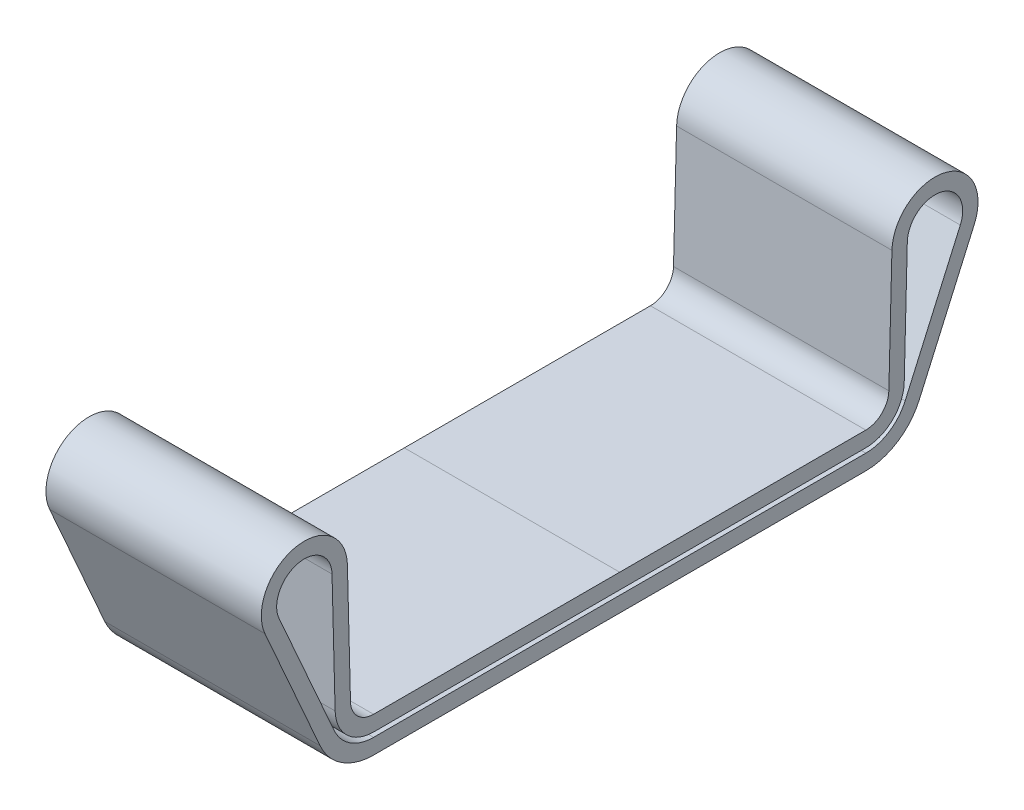
ISO-10303-21;
HEADER;
FILE_DESCRIPTION(('STEP AP214'),'2;1');
FILE_NAME('part.step','',(''),(''),'','','');
FILE_SCHEMA(('AUTOMOTIVE_DESIGN { 1 0 10303 214 1 1 1 1 }'));
ENDSEC;
DATA;
#1=APPLICATION_CONTEXT('core data for automotive mechanical design processes');
#2=APPLICATION_PROTOCOL_DEFINITION('international standard','automotive_design',2000,#1);
#3=PRODUCT_CONTEXT('',#1,'mechanical');
#4=PRODUCT('Part','Part','',(#3));
#5=PRODUCT_RELATED_PRODUCT_CATEGORY('part','',(#4));
#6=PRODUCT_DEFINITION_FORMATION('','',#4);
#7=PRODUCT_DEFINITION_CONTEXT('part definition',#1,'design');
#8=PRODUCT_DEFINITION('design','',#6,#7);
#9=PRODUCT_DEFINITION_SHAPE('','',#8);
#10=(LENGTH_UNIT() NAMED_UNIT(*) SI_UNIT(.MILLI.,.METRE.));
#11=(NAMED_UNIT(*) PLANE_ANGLE_UNIT() SI_UNIT($,.RADIAN.));
#12=(NAMED_UNIT(*) SI_UNIT($,.STERADIAN.) SOLID_ANGLE_UNIT());
#13=UNCERTAINTY_MEASURE_WITH_UNIT(LENGTH_MEASURE(1.E-05),#10,'distance_accuracy_value','');
#14=(GEOMETRIC_REPRESENTATION_CONTEXT(3) GLOBAL_UNCERTAINTY_ASSIGNED_CONTEXT((#13)) GLOBAL_UNIT_ASSIGNED_CONTEXT((#10,
#11,#12)) REPRESENTATION_CONTEXT('',''));
#15=CARTESIAN_POINT('',(0.,0.,0.));
#16=DIRECTION('',(0.,0.,1.));
#17=DIRECTION('',(1.,0.,0.));
#18=AXIS2_PLACEMENT_3D('',#15,#16,#17);
#19=CARTESIAN_POINT('',(7.,7.50000000000001,20.5));
#20=DIRECTION('',(-1.,0.,0.));
#21=DIRECTION('',(0.,0.,1.));
#22=AXIS2_PLACEMENT_3D('',#19,#20,#21);
#23=CYLINDRICAL_SURFACE('',#22,1.8);
#24=CARTESIAN_POINT('',(-7.,7.50000000000001,20.5));
#25=DIRECTION('',(-1.,0.,0.));
#26=DIRECTION('',(0.,0.,-1.));
#27=AXIS2_PLACEMENT_3D('',#24,#25,#26);
#28=CIRCLE('',#27,1.8);
#29=CARTESIAN_POINT('',(-7.,6.7718398936245,22.1461418102591));
#30=VERTEX_POINT('',#29);
#31=CARTESIAN_POINT('',(-7.,7.54628935623504,18.7005952941322));
#32=VERTEX_POINT('',#31);
#33=EDGE_CURVE('E177',#30,#32,#28,.T.);
#34=ORIENTED_EDGE('',*,*,#33,.T.);
#35=DIRECTION('',(-1.,0.,0.));
#36=VECTOR('',#35,1.);
#37=CARTESIAN_POINT('',(7.,7.54628935623504,18.7005952941322));
#38=LINE('',#37,#36);
#39=CARTESIAN_POINT('',(7.,7.54628935623504,18.7005952941322));
#40=VERTEX_POINT('',#39);
#41=EDGE_CURVE('E11',#40,#32,#38,.T.);
#42=ORIENTED_EDGE('',*,*,#41,.F.);
#43=CARTESIAN_POINT('',(7.,7.50000000000001,20.5));
#44=DIRECTION('',(-1.,0.,0.));
#45=DIRECTION('',(0.,0.,-1.));
#46=AXIS2_PLACEMENT_3D('',#43,#44,#45);
#47=CIRCLE('',#46,1.8);
#48=CARTESIAN_POINT('',(7.,6.7718398936245,22.1461418102591));
#49=VERTEX_POINT('',#48);
#50=EDGE_CURVE('E205',#49,#40,#47,.T.);
#51=ORIENTED_EDGE('',*,*,#50,.F.);
#52=DIRECTION('',(-1.,0.,0.));
#53=VECTOR('',#52,1.);
#54=CARTESIAN_POINT('',(7.,6.7718398936245,22.1461418102591));
#55=LINE('',#54,#53);
#56=EDGE_CURVE('E173',#49,#30,#55,.T.);
#57=ORIENTED_EDGE('',*,*,#56,.T.);
#58=EDGE_LOOP('',(#34,#42,#51,#57));
#59=FACE_BOUND('',#58,.T.);
#60=ADVANCED_FACE('F36',(#59),#23,.F.);
#61=CARTESIAN_POINT('',(7.,7.54628935623504,18.7005952941322));
#62=DIRECTION('',(0.,0.025716309019469,-0.999669281037692));
#63=DIRECTION('',(0.,0.999669281037692,0.025716309019469));
#64=AXIS2_PLACEMENT_3D('',#61,#62,#63);
#65=PLANE('',#64);
#66=DIRECTION('',(0.,-0.999669281037692,-0.0257163090194691));
#67=VECTOR('',#66,1.);
#68=CARTESIAN_POINT('',(-7.,7.54628935623504,18.7005952941322));
#69=LINE('',#68,#67);
#70=CARTESIAN_POINT('',(-7.,-0.26430130433916,18.4996692810377));
#71=VERTEX_POINT('',#70);
#72=EDGE_CURVE('E180',#32,#71,#69,.T.);
#73=ORIENTED_EDGE('',*,*,#72,.T.);
#74=DIRECTION('',(-1.,0.,0.));
#75=VECTOR('',#74,1.);
#76=CARTESIAN_POINT('',(7.,-0.26430130433916,18.4996692810377));
#77=LINE('',#76,#75);
#78=CARTESIAN_POINT('',(7.,-0.26430130433916,18.4996692810377));
#79=VERTEX_POINT('',#78);
#80=EDGE_CURVE('E44',#79,#71,#77,.T.);
#81=ORIENTED_EDGE('',*,*,#80,.F.);
#82=DIRECTION('',(0.,-0.999669281037692,-0.0257163090194691));
#83=VECTOR('',#82,1.);
#84=CARTESIAN_POINT('',(7.,7.54628935623504,18.7005952941322));
#85=LINE('',#84,#83);
#86=EDGE_CURVE('E111',#40,#79,#85,.T.);
#87=ORIENTED_EDGE('',*,*,#86,.F.);
#88=ORIENTED_EDGE('',*,*,#41,.T.);
#89=EDGE_LOOP('',(#73,#81,#87,#88));
#90=FACE_BOUND('',#89,.T.);
#91=ADVANCED_FACE('F488',(#90),#65,.F.);
#92=CARTESIAN_POINT('',(7.,-0.200010531790487,16.0004960784435));
#93=DIRECTION('',(-1.,0.,0.));
#94=DIRECTION('',(0.,0.,1.));
#95=AXIS2_PLACEMENT_3D('',#92,#93,#94);
#96=CYLINDRICAL_SURFACE('',#95,2.5);
#97=CARTESIAN_POINT('',(-7.,-0.200010531790487,16.0004960784435));
#98=DIRECTION('',(1.,0.,0.));
#99=DIRECTION('',(0.,0.,-1.));
#100=AXIS2_PLACEMENT_3D('',#97,#98,#99);
#101=CIRCLE('',#100,2.5);
#102=CARTESIAN_POINT('',(-7.,-2.70001053178995,16.0004944329022));
#103=VERTEX_POINT('',#102);
#104=EDGE_CURVE('E183',#71,#103,#101,.T.);
#105=ORIENTED_EDGE('',*,*,#104,.T.);
#106=DIRECTION('',(-1.,0.,0.));
#107=VECTOR('',#106,1.);
#108=CARTESIAN_POINT('',(7.,-2.70001053178995,16.0004944329022));
#109=LINE('',#108,#107);
#110=CARTESIAN_POINT('',(7.,-2.70001053178995,16.0004944329022));
#111=VERTEX_POINT('',#110);
#112=EDGE_CURVE('E234',#111,#103,#109,.T.);
#113=ORIENTED_EDGE('',*,*,#112,.F.);
#114=CARTESIAN_POINT('',(7.,-0.200010531790487,16.0004960784435));
#115=DIRECTION('',(1.,0.,0.));
#116=DIRECTION('',(0.,0.,-1.));
#117=AXIS2_PLACEMENT_3D('',#114,#115,#116);
#118=CIRCLE('',#117,2.5);
#119=EDGE_CURVE('E244',#79,#111,#118,.T.);
#120=ORIENTED_EDGE('',*,*,#119,.F.);
#121=ORIENTED_EDGE('',*,*,#80,.T.);
#122=EDGE_LOOP('',(#105,#113,#120,#121));
#123=FACE_BOUND('',#122,.T.);
#124=ADVANCED_FACE('F242',(#123),#96,.T.);
#125=CARTESIAN_POINT('',(7.,-2.70000000000084,0.));
#126=DIRECTION('',(0.,0.999999999999784,6.58216478839203E-07));
#127=DIRECTION('',(0.,-6.58216478839203E-07,0.999999999999784));
#128=AXIS2_PLACEMENT_3D('',#125,#126,#127);
#129=PLANE('',#128);
#130=DIRECTION('',(0.,6.58216478839203E-07,-0.999999999999783));
#131=VECTOR('',#130,1.);
#132=CARTESIAN_POINT('',(-7.,-2.70000000000084,0.));
#133=LINE('',#132,#131);
#134=CARTESIAN_POINT('',(-7.,-2.70000000000084,0.));
#135=VERTEX_POINT('',#134);
#136=EDGE_CURVE('E185',#103,#135,#133,.T.);
#137=ORIENTED_EDGE('',*,*,#136,.T.);
#138=DIRECTION('',(-1.,0.,0.));
#139=VECTOR('',#138,1.);
#140=CARTESIAN_POINT('',(7.,-2.70000000000084,0.));
#141=LINE('',#140,#139);
#142=CARTESIAN_POINT('',(7.,-2.70000000000084,0.));
#143=VERTEX_POINT('',#142);
#144=EDGE_CURVE('E231',#143,#135,#141,.T.);
#145=ORIENTED_EDGE('',*,*,#144,.F.);
#146=DIRECTION('',(0.,6.58216478839203E-07,-0.999999999999783));
#147=VECTOR('',#146,1.);
#148=CARTESIAN_POINT('',(7.,-2.70000000000084,0.));
#149=LINE('',#148,#147);
#150=EDGE_CURVE('E351',#111,#143,#149,.T.);
#151=ORIENTED_EDGE('',*,*,#150,.F.);
#152=ORIENTED_EDGE('',*,*,#112,.T.);
#153=EDGE_LOOP('',(#137,#145,#151,#152));
#154=FACE_BOUND('',#153,.T.);
#155=ADVANCED_FACE('F256',(#154),#129,.F.);
#156=CARTESIAN_POINT('',(7.,-1.70000000000085,0.));
#157=DIRECTION('',(0.,-0.999999999999784,-6.5821646306444E-07));
#158=DIRECTION('',(0.,6.5821646306444E-07,-0.999999999999784));
#159=AXIS2_PLACEMENT_3D('',#156,#157,#158);
#160=PLANE('',#159);
#161=DIRECTION('',(0.,-6.5821646306444E-07,0.999999999999783));
#162=VECTOR('',#161,1.);
#163=CARTESIAN_POINT('',(-7.,-1.70000000000085,0.));
#164=LINE('',#163,#162);
#165=CARTESIAN_POINT('',(-7.,-1.70000000000085,0.));
#166=VERTEX_POINT('',#165);
#167=CARTESIAN_POINT('',(-7.,-1.70001053179016,16.0004950911187));
#168=VERTEX_POINT('',#167);
#169=EDGE_CURVE('E187',#166,#168,#164,.T.);
#170=ORIENTED_EDGE('',*,*,#169,.T.);
#171=DIRECTION('',(-1.,0.,0.));
#172=VECTOR('',#171,1.);
#173=CARTESIAN_POINT('',(7.,-1.70001053179016,16.0004950911187));
#174=LINE('',#173,#172);
#175=CARTESIAN_POINT('',(7.,-1.70001053179016,16.0004950911187));
#176=VERTEX_POINT('',#175);
#177=EDGE_CURVE('E225',#176,#168,#174,.T.);
#178=ORIENTED_EDGE('',*,*,#177,.F.);
#179=DIRECTION('',(0.,-6.5821646306444E-07,0.999999999999783));
#180=VECTOR('',#179,1.);
#181=CARTESIAN_POINT('',(7.,-1.70000000000085,0.));
#182=LINE('',#181,#180);
#183=CARTESIAN_POINT('',(7.,-1.70000000000085,0.));
#184=VERTEX_POINT('',#183);
#185=EDGE_CURVE('E353',#184,#176,#182,.T.);
#186=ORIENTED_EDGE('',*,*,#185,.F.);
#187=DIRECTION('',(-1.,0.,0.));
#188=VECTOR('',#187,1.);
#189=CARTESIAN_POINT('',(7.,-1.70000000000085,0.));
#190=LINE('',#189,#188);
#191=EDGE_CURVE('E228',#184,#166,#190,.T.);
#192=ORIENTED_EDGE('',*,*,#191,.T.);
#193=EDGE_LOOP('',(#170,#178,#186,#192));
#194=FACE_BOUND('',#193,.T.);
#195=ADVANCED_FACE('F421',(#194),#160,.F.);
#196=CARTESIAN_POINT('',(7.,-0.200010531790487,16.0004960784435));
#197=DIRECTION('',(-1.,0.,0.));
#198=DIRECTION('',(0.,0.,1.));
#199=AXIS2_PLACEMENT_3D('',#196,#197,#198);
#200=CYLINDRICAL_SURFACE('',#199,1.49999999999999);
#201=CARTESIAN_POINT('',(-7.,-0.200010531790487,16.0004960784435));
#202=DIRECTION('',(-1.,0.,0.));
#203=DIRECTION('',(0.,0.,-1.));
#204=AXIS2_PLACEMENT_3D('',#201,#202,#203);
#205=CIRCLE('',#204,1.49999999999999);
#206=CARTESIAN_POINT('',(-7.,-0.238584995319702,17.5));
#207=VERTEX_POINT('',#206);
#208=EDGE_CURVE('E189',#168,#207,#205,.T.);
#209=ORIENTED_EDGE('',*,*,#208,.T.);
#210=DIRECTION('',(-1.,0.,0.));
#211=VECTOR('',#210,1.);
#212=CARTESIAN_POINT('',(7.,-0.238584995319702,17.5));
#213=LINE('',#212,#211);
#214=CARTESIAN_POINT('',(7.,-0.238584995319702,17.5));
#215=VERTEX_POINT('',#214);
#216=EDGE_CURVE('E221',#215,#207,#213,.T.);
#217=ORIENTED_EDGE('',*,*,#216,.F.);
#218=CARTESIAN_POINT('',(7.,-0.200010531790487,16.0004960784435));
#219=DIRECTION('',(-1.,0.,0.));
#220=DIRECTION('',(0.,0.,-1.));
#221=AXIS2_PLACEMENT_3D('',#218,#219,#220);
#222=CIRCLE('',#221,1.49999999999999);
#223=EDGE_CURVE('E355',#176,#215,#222,.T.);
#224=ORIENTED_EDGE('',*,*,#223,.F.);
#225=ORIENTED_EDGE('',*,*,#177,.T.);
#226=EDGE_LOOP('',(#209,#217,#224,#225));
#227=FACE_BOUND('',#226,.T.);
#228=ADVANCED_FACE('F689',(#227),#200,.F.);
#229=CARTESIAN_POINT('',(7.,7.57200566525451,17.7009260130945));
#230=DIRECTION('',(0.,-0.0257163090194695,0.999669281037691));
#231=DIRECTION('',(0.,-0.999669281037692,-0.0257163090194695));
#232=AXIS2_PLACEMENT_3D('',#229,#230,#231);
#233=PLANE('',#232);
#234=DIRECTION('',(0.,0.999669281037692,0.0257163090194695));
#235=VECTOR('',#234,1.);
#236=CARTESIAN_POINT('',(-7.,7.57200566525451,17.7009260130945));
#237=LINE('',#236,#235);
#238=CARTESIAN_POINT('',(-7.,7.57200566525451,17.7009260130945));
#239=VERTEX_POINT('',#238);
#240=EDGE_CURVE('E191',#207,#239,#237,.T.);
#241=ORIENTED_EDGE('',*,*,#240,.T.);
#242=DIRECTION('',(-1.,0.,0.));
#243=VECTOR('',#242,1.);
#244=CARTESIAN_POINT('',(7.,7.57200566525451,17.7009260130945));
#245=LINE('',#244,#243);
#246=CARTESIAN_POINT('',(7.,7.57200566525451,17.7009260130945));
#247=VERTEX_POINT('',#246);
#248=EDGE_CURVE('E218',#247,#239,#245,.T.);
#249=ORIENTED_EDGE('',*,*,#248,.F.);
#250=DIRECTION('',(0.,0.999669281037692,0.0257163090194695));
#251=VECTOR('',#250,1.);
#252=CARTESIAN_POINT('',(7.,7.57200566525451,17.7009260130945));
#253=LINE('',#252,#251);
#254=EDGE_CURVE('E357',#215,#247,#253,.T.);
#255=ORIENTED_EDGE('',*,*,#254,.F.);
#256=ORIENTED_EDGE('',*,*,#216,.T.);
#257=EDGE_LOOP('',(#241,#249,#255,#256));
#258=FACE_BOUND('',#257,.T.);
#259=ADVANCED_FACE('F679',(#258),#233,.F.);
#260=CARTESIAN_POINT('',(7.,7.50000000000001,20.5));
#261=DIRECTION('',(-1.,0.,0.));
#262=DIRECTION('',(0.,0.,1.));
#263=AXIS2_PLACEMENT_3D('',#260,#261,#262);
#264=CYLINDRICAL_SURFACE('',#263,2.80000000000001);
#265=CARTESIAN_POINT('',(-7.,7.50000000000001,20.5));
#266=DIRECTION('',(1.,0.,0.));
#267=DIRECTION('',(0.,0.,-1.));
#268=AXIS2_PLACEMENT_3D('',#265,#266,#267);
#269=CIRCLE('',#268,2.80000000000001);
#270=CARTESIAN_POINT('',(-7.,6.36730650119366,23.0606650381809));
#271=VERTEX_POINT('',#270);
#272=EDGE_CURVE('E193',#239,#271,#269,.T.);
#273=ORIENTED_EDGE('',*,*,#272,.T.);
#274=DIRECTION('',(-1.,0.,0.));
#275=VECTOR('',#274,1.);
#276=CARTESIAN_POINT('',(7.,6.36730650119366,23.0606650381809));
#277=LINE('',#276,#275);
#278=CARTESIAN_POINT('',(7.,6.36730650119366,23.0606650381809));
#279=VERTEX_POINT('',#278);
#280=EDGE_CURVE('E215',#279,#271,#277,.T.);
#281=ORIENTED_EDGE('',*,*,#280,.F.);
#282=CARTESIAN_POINT('',(7.,7.50000000000001,20.5));
#283=DIRECTION('',(1.,0.,0.));
#284=DIRECTION('',(0.,0.,-1.));
#285=AXIS2_PLACEMENT_3D('',#282,#283,#284);
#286=CIRCLE('',#285,2.80000000000001);
#287=EDGE_CURVE('E359',#247,#279,#286,.T.);
#288=ORIENTED_EDGE('',*,*,#287,.F.);
#289=ORIENTED_EDGE('',*,*,#248,.T.);
#290=EDGE_LOOP('',(#273,#281,#288,#289));
#291=FACE_BOUND('',#290,.T.);
#292=ADVANCED_FACE('F669',(#291),#264,.T.);
#293=CARTESIAN_POINT('',(7.,-1.73723316256695,19.4756747129795));
#294=DIRECTION('',(0.,0.404533392430836,-0.91452322792174));
#295=DIRECTION('',(0.,0.914523227921741,0.404533392430836));
#296=AXIS2_PLACEMENT_3D('',#293,#294,#295);
#297=PLANE('',#296);
#298=DIRECTION('',(0.,-0.91452322792174,-0.404533392430836));
#299=VECTOR('',#298,1.);
#300=CARTESIAN_POINT('',(-7.,-1.73723316256695,19.4756747129795));
#301=LINE('',#300,#299);
#302=CARTESIAN_POINT('',(-7.,-1.73723316256695,19.4756747129795));
#303=VERTEX_POINT('',#302);
#304=EDGE_CURVE('E195',#271,#303,#301,.T.);
#305=ORIENTED_EDGE('',*,*,#304,.T.);
#306=DIRECTION('',(-1.,0.,0.));
#307=VECTOR('',#306,1.);
#308=CARTESIAN_POINT('',(7.,-1.73723316256695,19.4756747129795));
#309=LINE('',#308,#307);
#310=CARTESIAN_POINT('',(7.,-1.73723316256695,19.4756747129795));
#311=VERTEX_POINT('',#310);
#312=EDGE_CURVE('E211',#311,#303,#309,.T.);
#313=ORIENTED_EDGE('',*,*,#312,.F.);
#314=DIRECTION('',(0.,-0.91452322792174,-0.404533392430836));
#315=VECTOR('',#314,1.);
#316=CARTESIAN_POINT('',(7.,-1.73723316256695,19.4756747129795));
#317=LINE('',#316,#315);
#318=EDGE_CURVE('E361',#279,#311,#317,.T.);
#319=ORIENTED_EDGE('',*,*,#318,.F.);
#320=ORIENTED_EDGE('',*,*,#280,.T.);
#321=EDGE_LOOP('',(#305,#313,#319,#320));
#322=FACE_BOUND('',#321,.T.);
#323=ADVANCED_FACE('F659',(#322),#297,.F.);
#324=CARTESIAN_POINT('',(7.,-0.200010531790487,16.0004960784435));
#325=DIRECTION('',(-1.,0.,0.));
#326=DIRECTION('',(0.,0.,1.));
#327=AXIS2_PLACEMENT_3D('',#324,#325,#326);
#328=CYLINDRICAL_SURFACE('',#327,3.79998946821005);
#329=CARTESIAN_POINT('',(-7.,-0.200010531790487,16.0004960784435));
#330=DIRECTION('',(1.,0.,0.));
#331=DIRECTION('',(0.,0.,1.));
#332=AXIS2_PLACEMENT_3D('',#329,#330,#331);
#333=CIRCLE('',#332,3.79998946821005);
#334=CARTESIAN_POINT('',(-7.,-4.00000000000053,16.0004960784435));
#335=VERTEX_POINT('',#334);
#336=EDGE_CURVE('E197',#303,#335,#333,.T.);
#337=ORIENTED_EDGE('',*,*,#336,.T.);
#338=DIRECTION('',(-1.,0.,0.));
#339=VECTOR('',#338,1.);
#340=CARTESIAN_POINT('',(7.,-4.00000000000053,16.0004960784435));
#341=LINE('',#340,#339);
#342=CARTESIAN_POINT('',(7.,-4.00000000000053,16.0004960784435));
#343=VERTEX_POINT('',#342);
#344=EDGE_CURVE('E165',#343,#335,#341,.T.);
#345=ORIENTED_EDGE('',*,*,#344,.F.);
#346=CARTESIAN_POINT('',(7.,-0.200010531790487,16.0004960784435));
#347=DIRECTION('',(1.,0.,0.));
#348=DIRECTION('',(0.,0.,1.));
#349=AXIS2_PLACEMENT_3D('',#346,#347,#348);
#350=CIRCLE('',#349,3.79998946821005);
#351=EDGE_CURVE('E363',#311,#343,#350,.T.);
#352=ORIENTED_EDGE('',*,*,#351,.F.);
#353=ORIENTED_EDGE('',*,*,#312,.T.);
#354=EDGE_LOOP('',(#337,#345,#352,#353));
#355=FACE_BOUND('',#354,.T.);
#356=ADVANCED_FACE('F648',(#355),#328,.T.);
#357=CARTESIAN_POINT('',(7.,-4.00000000000084,0.));
#358=DIRECTION('',(0.,1.,0.));
#359=DIRECTION('',(0.,0.,1.));
#360=AXIS2_PLACEMENT_3D('',#357,#358,#359);
#361=PLANE('',#360);
#362=DIRECTION('',(0.,0.,-1.));
#363=VECTOR('',#362,1.);
#364=CARTESIAN_POINT('',(-7.,-4.00000000000084,0.));
#365=LINE('',#364,#363);
#366=CARTESIAN_POINT('',(-7.,-4.00000000000053,-16.0004960784435));
#367=VERTEX_POINT('',#366);
#368=EDGE_CURVE('E199',#335,#367,#365,.T.);
#369=ORIENTED_EDGE('',*,*,#368,.T.);
#370=DIRECTION('',(-1.,0.,0.));
#371=VECTOR('',#370,1.);
#372=CARTESIAN_POINT('',(7.,-4.00000000000053,-16.0004960784435));
#373=LINE('',#372,#371);
#374=CARTESIAN_POINT('',(7.,-4.00000000000053,-16.0004960784435));
#375=VERTEX_POINT('',#374);
#376=EDGE_CURVE('E338',#375,#367,#373,.T.);
#377=ORIENTED_EDGE('',*,*,#376,.F.);
#378=DIRECTION('',(0.,0.,-1.));
#379=VECTOR('',#378,1.);
#380=CARTESIAN_POINT('',(7.,-4.00000000000084,0.));
#381=LINE('',#380,#379);
#382=EDGE_CURVE('E159',#343,#375,#381,.T.);
#383=ORIENTED_EDGE('',*,*,#382,.F.);
#384=ORIENTED_EDGE('',*,*,#344,.T.);
#385=EDGE_LOOP('',(#369,#377,#383,#384));
#386=FACE_BOUND('',#385,.T.);
#387=ADVANCED_FACE('F378',(#386),#361,.F.);
#388=CARTESIAN_POINT('',(7.,-3.00000000000085,0.));
#389=DIRECTION('',(0.,-1.,0.));
#390=DIRECTION('',(0.,0.,-1.));
#391=AXIS2_PLACEMENT_3D('',#388,#389,#390);
#392=PLANE('',#391);
#393=DIRECTION('',(0.,0.,1.));
#394=VECTOR('',#393,1.);
#395=CARTESIAN_POINT('',(-7.,-3.00000000000085,0.));
#396=LINE('',#395,#394);
#397=CARTESIAN_POINT('',(-7.,-3.00000000000053,-16.0004960784435));
#398=VERTEX_POINT('',#397);
#399=CARTESIAN_POINT('',(-7.,-3.00000000000053,16.0004960784435));
#400=VERTEX_POINT('',#399);
#401=EDGE_CURVE('E164',#398,#400,#396,.T.);
#402=ORIENTED_EDGE('',*,*,#401,.T.);
#403=DIRECTION('',(-1.,0.,0.));
#404=VECTOR('',#403,1.);
#405=CARTESIAN_POINT('',(7.,-3.00000000000053,16.0004960784435));
#406=LINE('',#405,#404);
#407=CARTESIAN_POINT('',(7.,-3.00000000000053,16.0004960784435));
#408=VERTEX_POINT('',#407);
#409=EDGE_CURVE('E161',#408,#400,#406,.T.);
#410=ORIENTED_EDGE('',*,*,#409,.F.);
#411=DIRECTION('',(0.,0.,1.));
#412=VECTOR('',#411,1.);
#413=CARTESIAN_POINT('',(7.,-3.00000000000085,0.));
#414=LINE('',#413,#412);
#415=CARTESIAN_POINT('',(7.,-3.00000000000053,-16.0004960784435));
#416=VERTEX_POINT('',#415);
#417=EDGE_CURVE('E146',#416,#408,#414,.T.);
#418=ORIENTED_EDGE('',*,*,#417,.F.);
#419=DIRECTION('',(-1.,0.,0.));
#420=VECTOR('',#419,1.);
#421=CARTESIAN_POINT('',(7.,-3.00000000000053,-16.0004960784435));
#422=LINE('',#421,#420);
#423=EDGE_CURVE('E341',#416,#398,#422,.T.);
#424=ORIENTED_EDGE('',*,*,#423,.T.);
#425=EDGE_LOOP('',(#402,#410,#418,#424));
#426=FACE_BOUND('',#425,.T.);
#427=ADVANCED_FACE('F162',(#426),#392,.F.);
#428=CARTESIAN_POINT('',(7.,-0.200010531790487,16.0004960784435));
#429=DIRECTION('',(-1.,0.,0.));
#430=DIRECTION('',(0.,0.,1.));
#431=AXIS2_PLACEMENT_3D('',#428,#429,#430);
#432=CYLINDRICAL_SURFACE('',#431,2.79998946821004);
#433=CARTESIAN_POINT('',(-7.,-0.200010531790487,16.0004960784435));
#434=DIRECTION('',(-1.,0.,0.));
#435=DIRECTION('',(0.,0.,-1.));
#436=AXIS2_PLACEMENT_3D('',#433,#434,#435);
#437=CIRCLE('',#436,2.79998946821004);
#438=CARTESIAN_POINT('',(-7.,-1.33269977013611,18.5611514850578));
#439=VERTEX_POINT('',#438);
#440=EDGE_CURVE('E97',#400,#439,#437,.T.);
#441=ORIENTED_EDGE('',*,*,#440,.T.);
#442=DIRECTION('',(-1.,0.,0.));
#443=VECTOR('',#442,1.);
#444=CARTESIAN_POINT('',(7.,-1.33269977013611,18.5611514850578));
#445=LINE('',#444,#443);
#446=CARTESIAN_POINT('',(7.,-1.33269977013611,18.5611514850578));
#447=VERTEX_POINT('',#446);
#448=EDGE_CURVE('E166',#447,#439,#445,.T.);
#449=ORIENTED_EDGE('',*,*,#448,.F.);
#450=CARTESIAN_POINT('',(7.,-0.200010531790487,16.0004960784435));
#451=DIRECTION('',(-1.,0.,0.));
#452=DIRECTION('',(0.,0.,-1.));
#453=AXIS2_PLACEMENT_3D('',#450,#451,#452);
#454=CIRCLE('',#453,2.79998946821004);
#455=EDGE_CURVE('E151',#408,#447,#454,.T.);
#456=ORIENTED_EDGE('',*,*,#455,.F.);
#457=ORIENTED_EDGE('',*,*,#409,.T.);
#458=EDGE_LOOP('',(#441,#449,#456,#457));
#459=FACE_BOUND('',#458,.T.);
#460=ADVANCED_FACE('F168',(#459),#432,.F.);
#461=CARTESIAN_POINT('',(7.,6.7718398936245,22.1461418102591));
#462=DIRECTION('',(0.,-0.404533392430836,0.91452322792174));
#463=DIRECTION('',(0.,-0.91452322792174,-0.404533392430836));
#464=AXIS2_PLACEMENT_3D('',#461,#462,#463);
#465=PLANE('',#464);
#466=DIRECTION('',(0.,0.91452322792174,0.404533392430836));
#467=VECTOR('',#466,1.);
#468=CARTESIAN_POINT('',(-7.,6.7718398936245,22.1461418102591));
#469=LINE('',#468,#467);
#470=EDGE_CURVE('E103',#439,#30,#469,.T.);
#471=ORIENTED_EDGE('',*,*,#470,.T.);
#472=ORIENTED_EDGE('',*,*,#56,.F.);
#473=DIRECTION('',(0.,0.91452322792174,0.404533392430836));
#474=VECTOR('',#473,1.);
#475=CARTESIAN_POINT('',(7.,6.7718398936245,22.1461418102591));
#476=LINE('',#475,#474);
#477=EDGE_CURVE('E52',#447,#49,#476,.T.);
#478=ORIENTED_EDGE('',*,*,#477,.F.);
#479=ORIENTED_EDGE('',*,*,#448,.T.);
#480=EDGE_LOOP('',(#471,#472,#478,#479));
#481=FACE_BOUND('',#480,.T.);
#482=ADVANCED_FACE('F484',(#481),#465,.F.);
#483=CARTESIAN_POINT('',(7.,7.50000000000001,20.5));
#484=DIRECTION('',(1.,0.,0.));
#485=DIRECTION('',(0.,0.,-1.));
#486=AXIS2_PLACEMENT_3D('',#483,#484,#485);
#487=PLANE('',#486);
#488=CARTESIAN_POINT('',(7.,-0.200010531790487,-16.0004960784435));
#489=DIRECTION('',(1.,0.,0.));
#490=DIRECTION('',(0.,0.,1.));
#491=AXIS2_PLACEMENT_3D('',#488,#489,#490);
#492=CIRCLE('',#491,2.79998946821004);
#493=CARTESIAN_POINT('',(7.,-1.33269977013611,-18.5611514850578));
#494=VERTEX_POINT('',#493);
#495=EDGE_CURVE('E155',#416,#494,#492,.T.);
#496=ORIENTED_EDGE('',*,*,#495,.F.);
#497=ORIENTED_EDGE('',*,*,#417,.T.);
#498=ORIENTED_EDGE('',*,*,#455,.T.);
#499=ORIENTED_EDGE('',*,*,#477,.T.);
#500=ORIENTED_EDGE('',*,*,#50,.T.);
#501=ORIENTED_EDGE('',*,*,#86,.T.);
#502=ORIENTED_EDGE('',*,*,#119,.T.);
#503=ORIENTED_EDGE('',*,*,#150,.T.);
#504=DIRECTION('',(0.,6.58216478839203E-07,0.999999999999783));
#505=VECTOR('',#504,1.);
#506=CARTESIAN_POINT('',(7.,-2.70000000000084,0.));
#507=LINE('',#506,#505);
#508=CARTESIAN_POINT('',(7.,-2.70001053178995,-16.0004944329022));
#509=VERTEX_POINT('',#508);
#510=EDGE_CURVE('E264',#509,#143,#507,.T.);
#511=ORIENTED_EDGE('',*,*,#510,.F.);
#512=CARTESIAN_POINT('',(7.,-0.200010531790487,-16.0004960784435));
#513=DIRECTION('',(-1.,0.,0.));
#514=DIRECTION('',(0.,0.,1.));
#515=AXIS2_PLACEMENT_3D('',#512,#513,#514);
#516=CIRCLE('',#515,2.5);
#517=CARTESIAN_POINT('',(7.,-0.26430130433916,-18.4996692810377));
#518=VERTEX_POINT('',#517);
#519=EDGE_CURVE('E270',#518,#509,#516,.T.);
#520=ORIENTED_EDGE('',*,*,#519,.F.);
#521=DIRECTION('',(0.,-0.999669281037692,0.0257163090194691));
#522=VECTOR('',#521,1.);
#523=CARTESIAN_POINT('',(7.,7.54628935623504,-18.7005952941322));
#524=LINE('',#523,#522);
#525=CARTESIAN_POINT('',(7.,7.54628935623504,-18.7005952941322));
#526=VERTEX_POINT('',#525);
#527=EDGE_CURVE('E273',#526,#518,#524,.T.);
#528=ORIENTED_EDGE('',*,*,#527,.F.);
#529=CARTESIAN_POINT('',(7.,7.50000000000001,-20.5));
#530=DIRECTION('',(1.,0.,0.));
#531=DIRECTION('',(0.,0.,1.));
#532=AXIS2_PLACEMENT_3D('',#529,#530,#531);
#533=CIRCLE('',#532,1.8);
#534=CARTESIAN_POINT('',(7.,6.7718398936245,-22.1461418102591));
#535=VERTEX_POINT('',#534);
#536=EDGE_CURVE('E316',#535,#526,#533,.T.);
#537=ORIENTED_EDGE('',*,*,#536,.F.);
#538=DIRECTION('',(0.,0.91452322792174,-0.404533392430836));
#539=VECTOR('',#538,1.);
#540=CARTESIAN_POINT('',(7.,6.7718398936245,-22.1461418102591));
#541=LINE('',#540,#539);
#542=EDGE_CURVE('E389',#494,#535,#541,.T.);
#543=ORIENTED_EDGE('',*,*,#542,.F.);
#544=EDGE_LOOP('',(#496,#497,#498,#499,#500,#501,#502,#503,#511,#520,#528,#537,#543));
#545=FACE_BOUND('',#544,.T.);
#546=ORIENTED_EDGE('',*,*,#382,.T.);
#547=CARTESIAN_POINT('',(7.,-0.200010531790487,-16.0004960784435));
#548=DIRECTION('',(-1.,0.,0.));
#549=DIRECTION('',(0.,0.,-1.));
#550=AXIS2_PLACEMENT_3D('',#547,#548,#549);
#551=CIRCLE('',#550,3.79998946821005);
#552=CARTESIAN_POINT('',(7.,-1.73723316256695,-19.4756747129795));
#553=VERTEX_POINT('',#552);
#554=EDGE_CURVE('E372',#553,#375,#551,.T.);
#555=ORIENTED_EDGE('',*,*,#554,.F.);
#556=DIRECTION('',(0.,-0.91452322792174,0.404533392430836));
#557=VECTOR('',#556,1.);
#558=CARTESIAN_POINT('',(7.,-1.73723316256695,-19.4756747129795));
#559=LINE('',#558,#557);
#560=CARTESIAN_POINT('',(7.,6.36730650119366,-23.0606650381809));
#561=VERTEX_POINT('',#560);
#562=EDGE_CURVE('E385',#561,#553,#559,.T.);
#563=ORIENTED_EDGE('',*,*,#562,.F.);
#564=CARTESIAN_POINT('',(7.,7.50000000000001,-20.5));
#565=DIRECTION('',(-1.,0.,0.));
#566=DIRECTION('',(0.,0.,1.));
#567=AXIS2_PLACEMENT_3D('',#564,#565,#566);
#568=CIRCLE('',#567,2.80000000000001);
#569=CARTESIAN_POINT('',(7.,7.57200566525451,-17.7009260130945));
#570=VERTEX_POINT('',#569);
#571=EDGE_CURVE('E387',#570,#561,#568,.T.);
#572=ORIENTED_EDGE('',*,*,#571,.F.);
#573=DIRECTION('',(0.,0.999669281037692,-0.0257163090194695));
#574=VECTOR('',#573,1.);
#575=CARTESIAN_POINT('',(7.,7.57200566525451,-17.7009260130945));
#576=LINE('',#575,#574);
#577=CARTESIAN_POINT('',(7.,-0.238584995319702,-17.5));
#578=VERTEX_POINT('',#577);
#579=EDGE_CURVE('E395',#578,#570,#576,.T.);
#580=ORIENTED_EDGE('',*,*,#579,.F.);
#581=CARTESIAN_POINT('',(7.,-0.200010531790487,-16.0004960784435));
#582=DIRECTION('',(1.,0.,0.));
#583=DIRECTION('',(0.,0.,1.));
#584=AXIS2_PLACEMENT_3D('',#581,#582,#583);
#585=CIRCLE('',#584,1.49999999999999);
#586=CARTESIAN_POINT('',(7.,-1.70001053179016,-16.0004950911187));
#587=VERTEX_POINT('',#586);
#588=EDGE_CURVE('E276',#587,#578,#585,.T.);
#589=ORIENTED_EDGE('',*,*,#588,.F.);
#590=DIRECTION('',(0.,-6.5821646306444E-07,-0.999999999999783));
#591=VECTOR('',#590,1.);
#592=CARTESIAN_POINT('',(7.,-1.70000000000085,0.));
#593=LINE('',#592,#591);
#594=EDGE_CURVE('E271',#184,#587,#593,.T.);
#595=ORIENTED_EDGE('',*,*,#594,.F.);
#596=ORIENTED_EDGE('',*,*,#185,.T.);
#597=ORIENTED_EDGE('',*,*,#223,.T.);
#598=ORIENTED_EDGE('',*,*,#254,.T.);
#599=ORIENTED_EDGE('',*,*,#287,.T.);
#600=ORIENTED_EDGE('',*,*,#318,.T.);
#601=ORIENTED_EDGE('',*,*,#351,.T.);
#602=EDGE_LOOP('',(#546,#555,#563,#572,#580,#589,#595,#596,#597,#598,#599,#600,#601));
#603=FACE_BOUND('',#602,.T.);
#604=ADVANCED_FACE('F148',(#545,#603),#487,.T.);
#605=CARTESIAN_POINT('',(-7.,7.50000000000001,20.5));
#606=DIRECTION('',(1.,0.,0.));
#607=DIRECTION('',(0.,0.,-1.));
#608=AXIS2_PLACEMENT_3D('',#605,#606,#607);
#609=PLANE('',#608);
#610=ORIENTED_EDGE('',*,*,#401,.F.);
#611=CARTESIAN_POINT('',(-7.,-0.200010531790487,-16.0004960784435));
#612=DIRECTION('',(1.,0.,0.));
#613=DIRECTION('',(0.,0.,1.));
#614=AXIS2_PLACEMENT_3D('',#611,#612,#613);
#615=CIRCLE('',#614,2.79998946821004);
#616=CARTESIAN_POINT('',(-7.,-1.33269977013611,-18.5611514850578));
#617=VERTEX_POINT('',#616);
#618=EDGE_CURVE('E289',#398,#617,#615,.T.);
#619=ORIENTED_EDGE('',*,*,#618,.T.);
#620=DIRECTION('',(0.,0.91452322792174,-0.404533392430836));
#621=VECTOR('',#620,1.);
#622=CARTESIAN_POINT('',(-7.,6.7718398936245,-22.1461418102591));
#623=LINE('',#622,#621);
#624=CARTESIAN_POINT('',(-7.,6.7718398936245,-22.1461418102591));
#625=VERTEX_POINT('',#624);
#626=EDGE_CURVE('E286',#617,#625,#623,.T.);
#627=ORIENTED_EDGE('',*,*,#626,.T.);
#628=CARTESIAN_POINT('',(-7.,7.50000000000001,-20.5));
#629=DIRECTION('',(1.,0.,0.));
#630=DIRECTION('',(0.,0.,1.));
#631=AXIS2_PLACEMENT_3D('',#628,#629,#630);
#632=CIRCLE('',#631,1.8);
#633=CARTESIAN_POINT('',(-7.,7.54628935623504,-18.7005952941322));
#634=VERTEX_POINT('',#633);
#635=EDGE_CURVE('E283',#625,#634,#632,.T.);
#636=ORIENTED_EDGE('',*,*,#635,.T.);
#637=DIRECTION('',(0.,-0.999669281037692,0.0257163090194691));
#638=VECTOR('',#637,1.);
#639=CARTESIAN_POINT('',(-7.,7.54628935623504,-18.7005952941322));
#640=LINE('',#639,#638);
#641=CARTESIAN_POINT('',(-7.,-0.26430130433916,-18.4996692810377));
#642=VERTEX_POINT('',#641);
#643=EDGE_CURVE('E313',#634,#642,#640,.T.);
#644=ORIENTED_EDGE('',*,*,#643,.T.);
#645=CARTESIAN_POINT('',(-7.,-0.200010531790487,-16.0004960784435));
#646=DIRECTION('',(-1.,0.,0.));
#647=DIRECTION('',(0.,0.,1.));
#648=AXIS2_PLACEMENT_3D('',#645,#646,#647);
#649=CIRCLE('',#648,2.5);
#650=CARTESIAN_POINT('',(-7.,-2.70001053178995,-16.0004944329022));
#651=VERTEX_POINT('',#650);
#652=EDGE_CURVE('E311',#642,#651,#649,.T.);
#653=ORIENTED_EDGE('',*,*,#652,.T.);
#654=DIRECTION('',(0.,6.58216478839203E-07,0.999999999999783));
#655=VECTOR('',#654,1.);
#656=CARTESIAN_POINT('',(-7.,-2.70000000000084,0.));
#657=LINE('',#656,#655);
#658=EDGE_CURVE('E253',#651,#135,#657,.T.);
#659=ORIENTED_EDGE('',*,*,#658,.T.);
#660=ORIENTED_EDGE('',*,*,#136,.F.);
#661=ORIENTED_EDGE('',*,*,#104,.F.);
#662=ORIENTED_EDGE('',*,*,#72,.F.);
#663=ORIENTED_EDGE('',*,*,#33,.F.);
#664=ORIENTED_EDGE('',*,*,#470,.F.);
#665=ORIENTED_EDGE('',*,*,#440,.F.);
#666=EDGE_LOOP('',(#610,#619,#627,#636,#644,#653,#659,#660,#661,#662,#663,#664,#665));
#667=FACE_BOUND('',#666,.T.);
#668=CARTESIAN_POINT('',(-7.,-0.200010531790487,-16.0004960784435));
#669=DIRECTION('',(-1.,0.,0.));
#670=DIRECTION('',(0.,0.,-1.));
#671=AXIS2_PLACEMENT_3D('',#668,#669,#670);
#672=CIRCLE('',#671,3.79998946821005);
#673=CARTESIAN_POINT('',(-7.,-1.73723316256695,-19.4756747129795));
#674=VERTEX_POINT('',#673);
#675=EDGE_CURVE('E292',#674,#367,#672,.T.);
#676=ORIENTED_EDGE('',*,*,#675,.T.);
#677=ORIENTED_EDGE('',*,*,#368,.F.);
#678=ORIENTED_EDGE('',*,*,#336,.F.);
#679=ORIENTED_EDGE('',*,*,#304,.F.);
#680=ORIENTED_EDGE('',*,*,#272,.F.);
#681=ORIENTED_EDGE('',*,*,#240,.F.);
#682=ORIENTED_EDGE('',*,*,#208,.F.);
#683=ORIENTED_EDGE('',*,*,#169,.F.);
#684=DIRECTION('',(0.,-6.5821646306444E-07,-0.999999999999783));
#685=VECTOR('',#684,1.);
#686=CARTESIAN_POINT('',(-7.,-1.70000000000085,0.));
#687=LINE('',#686,#685);
#688=CARTESIAN_POINT('',(-7.,-1.70001053179016,-16.0004950911187));
#689=VERTEX_POINT('',#688);
#690=EDGE_CURVE('E307',#166,#689,#687,.T.);
#691=ORIENTED_EDGE('',*,*,#690,.T.);
#692=CARTESIAN_POINT('',(-7.,-0.200010531790487,-16.0004960784435));
#693=DIRECTION('',(1.,0.,0.));
#694=DIRECTION('',(0.,0.,1.));
#695=AXIS2_PLACEMENT_3D('',#692,#693,#694);
#696=CIRCLE('',#695,1.49999999999999);
#697=CARTESIAN_POINT('',(-7.,-0.238584995319702,-17.5));
#698=VERTEX_POINT('',#697);
#699=EDGE_CURVE('E304',#689,#698,#696,.T.);
#700=ORIENTED_EDGE('',*,*,#699,.T.);
#701=DIRECTION('',(0.,0.999669281037692,-0.0257163090194695));
#702=VECTOR('',#701,1.);
#703=CARTESIAN_POINT('',(-7.,7.57200566525451,-17.7009260130945));
#704=LINE('',#703,#702);
#705=CARTESIAN_POINT('',(-7.,7.57200566525451,-17.7009260130945));
#706=VERTEX_POINT('',#705);
#707=EDGE_CURVE('E301',#698,#706,#704,.T.);
#708=ORIENTED_EDGE('',*,*,#707,.T.);
#709=CARTESIAN_POINT('',(-7.,7.50000000000001,-20.5));
#710=DIRECTION('',(-1.,0.,0.));
#711=DIRECTION('',(0.,0.,1.));
#712=AXIS2_PLACEMENT_3D('',#709,#710,#711);
#713=CIRCLE('',#712,2.80000000000001);
#714=CARTESIAN_POINT('',(-7.,6.36730650119366,-23.0606650381809));
#715=VERTEX_POINT('',#714);
#716=EDGE_CURVE('E298',#706,#715,#713,.T.);
#717=ORIENTED_EDGE('',*,*,#716,.T.);
#718=DIRECTION('',(0.,-0.91452322792174,0.404533392430836));
#719=VECTOR('',#718,1.);
#720=CARTESIAN_POINT('',(-7.,-1.73723316256695,-19.4756747129795));
#721=LINE('',#720,#719);
#722=EDGE_CURVE('E295',#715,#674,#721,.T.);
#723=ORIENTED_EDGE('',*,*,#722,.T.);
#724=EDGE_LOOP('',(#676,#677,#678,#679,#680,#681,#682,#683,#691,#700,#708,#717,#723));
#725=FACE_BOUND('',#724,.T.);
#726=ADVANCED_FACE('F247',(#667,#725),#609,.F.);
#727=CARTESIAN_POINT('',(7.,7.50000000000001,-20.5));
#728=DIRECTION('',(-1.,0.,0.));
#729=DIRECTION('',(0.,0.,1.));
#730=AXIS2_PLACEMENT_3D('',#727,#728,#729);
#731=CYLINDRICAL_SURFACE('',#730,1.8);
#732=ORIENTED_EDGE('',*,*,#635,.F.);
#733=DIRECTION('',(-1.,0.,0.));
#734=VECTOR('',#733,1.);
#735=CARTESIAN_POINT('',(7.,6.7718398936245,-22.1461418102591));
#736=LINE('',#735,#734);
#737=EDGE_CURVE('E181',#535,#625,#736,.T.);
#738=ORIENTED_EDGE('',*,*,#737,.F.);
#739=ORIENTED_EDGE('',*,*,#536,.T.);
#740=DIRECTION('',(-1.,0.,0.));
#741=VECTOR('',#740,1.);
#742=CARTESIAN_POINT('',(7.,7.54628935623504,-18.7005952941322));
#743=LINE('',#742,#741);
#744=EDGE_CURVE('E282',#526,#634,#743,.T.);
#745=ORIENTED_EDGE('',*,*,#744,.T.);
#746=EDGE_LOOP('',(#732,#738,#739,#745));
#747=FACE_BOUND('',#746,.T.);
#748=ADVANCED_FACE('F476',(#747),#731,.F.);
#749=CARTESIAN_POINT('',(7.,6.7718398936245,-22.1461418102591));
#750=DIRECTION('',(0.,0.404533392430836,0.91452322792174));
#751=DIRECTION('',(0.,-0.91452322792174,0.404533392430836));
#752=AXIS2_PLACEMENT_3D('',#749,#750,#751);
#753=PLANE('',#752);
#754=ORIENTED_EDGE('',*,*,#626,.F.);
#755=DIRECTION('',(-1.,0.,0.));
#756=VECTOR('',#755,1.);
#757=CARTESIAN_POINT('',(7.,-1.33269977013611,-18.5611514850578));
#758=LINE('',#757,#756);
#759=EDGE_CURVE('E343',#494,#617,#758,.T.);
#760=ORIENTED_EDGE('',*,*,#759,.F.);
#761=ORIENTED_EDGE('',*,*,#542,.T.);
#762=ORIENTED_EDGE('',*,*,#737,.T.);
#763=EDGE_LOOP('',(#754,#760,#761,#762));
#764=FACE_BOUND('',#763,.T.);
#765=ADVANCED_FACE('F482',(#764),#753,.T.);
#766=CARTESIAN_POINT('',(7.,-0.200010531790487,-16.0004960784435));
#767=DIRECTION('',(-1.,0.,0.));
#768=DIRECTION('',(0.,0.,1.));
#769=AXIS2_PLACEMENT_3D('',#766,#767,#768);
#770=CYLINDRICAL_SURFACE('',#769,2.79998946821004);
#771=ORIENTED_EDGE('',*,*,#618,.F.);
#772=ORIENTED_EDGE('',*,*,#423,.F.);
#773=ORIENTED_EDGE('',*,*,#495,.T.);
#774=ORIENTED_EDGE('',*,*,#759,.T.);
#775=EDGE_LOOP('',(#771,#772,#773,#774));
#776=FACE_BOUND('',#775,.T.);
#777=ADVANCED_FACE('F497',(#776),#770,.F.);
#778=CARTESIAN_POINT('',(7.,-0.200010531790487,-16.0004960784435));
#779=DIRECTION('',(-1.,0.,0.));
#780=DIRECTION('',(0.,0.,1.));
#781=AXIS2_PLACEMENT_3D('',#778,#779,#780);
#782=CYLINDRICAL_SURFACE('',#781,3.79998946821005);
#783=ORIENTED_EDGE('',*,*,#675,.F.);
#784=DIRECTION('',(-1.,0.,0.));
#785=VECTOR('',#784,1.);
#786=CARTESIAN_POINT('',(7.,-1.73723316256695,-19.4756747129795));
#787=LINE('',#786,#785);
#788=EDGE_CURVE('E335',#553,#674,#787,.T.);
#789=ORIENTED_EDGE('',*,*,#788,.F.);
#790=ORIENTED_EDGE('',*,*,#554,.T.);
#791=ORIENTED_EDGE('',*,*,#376,.T.);
#792=EDGE_LOOP('',(#783,#789,#790,#791));
#793=FACE_BOUND('',#792,.T.);
#794=ADVANCED_FACE('F384',(#793),#782,.T.);
#795=CARTESIAN_POINT('',(7.,-1.73723316256695,-19.4756747129795));
#796=DIRECTION('',(0.,-0.404533392430836,-0.91452322792174));
#797=DIRECTION('',(0.,0.914523227921741,-0.404533392430836));
#798=AXIS2_PLACEMENT_3D('',#795,#796,#797);
#799=PLANE('',#798);
#800=ORIENTED_EDGE('',*,*,#722,.F.);
#801=DIRECTION('',(-1.,0.,0.));
#802=VECTOR('',#801,1.);
#803=CARTESIAN_POINT('',(7.,6.36730650119366,-23.0606650381809));
#804=LINE('',#803,#802);
#805=EDGE_CURVE('E332',#561,#715,#804,.T.);
#806=ORIENTED_EDGE('',*,*,#805,.F.);
#807=ORIENTED_EDGE('',*,*,#562,.T.);
#808=ORIENTED_EDGE('',*,*,#788,.T.);
#809=EDGE_LOOP('',(#800,#806,#807,#808));
#810=FACE_BOUND('',#809,.T.);
#811=ADVANCED_FACE('F523',(#810),#799,.T.);
#812=CARTESIAN_POINT('',(7.,7.50000000000001,-20.5));
#813=DIRECTION('',(-1.,0.,0.));
#814=DIRECTION('',(0.,0.,1.));
#815=AXIS2_PLACEMENT_3D('',#812,#813,#814);
#816=CYLINDRICAL_SURFACE('',#815,2.80000000000001);
#817=ORIENTED_EDGE('',*,*,#716,.F.);
#818=DIRECTION('',(-1.,0.,0.));
#819=VECTOR('',#818,1.);
#820=CARTESIAN_POINT('',(7.,7.57200566525451,-17.7009260130945));
#821=LINE('',#820,#819);
#822=EDGE_CURVE('E329',#570,#706,#821,.T.);
#823=ORIENTED_EDGE('',*,*,#822,.F.);
#824=ORIENTED_EDGE('',*,*,#571,.T.);
#825=ORIENTED_EDGE('',*,*,#805,.T.);
#826=EDGE_LOOP('',(#817,#823,#824,#825));
#827=FACE_BOUND('',#826,.T.);
#828=ADVANCED_FACE('F473',(#827),#816,.T.);
#829=CARTESIAN_POINT('',(7.,7.57200566525451,-17.7009260130945));
#830=DIRECTION('',(0.,0.0257163090194695,0.999669281037691));
#831=DIRECTION('',(0.,-0.999669281037692,0.0257163090194695));
#832=AXIS2_PLACEMENT_3D('',#829,#830,#831);
#833=PLANE('',#832);
#834=ORIENTED_EDGE('',*,*,#707,.F.);
#835=DIRECTION('',(-1.,0.,0.));
#836=VECTOR('',#835,1.);
#837=CARTESIAN_POINT('',(7.,-0.238584995319702,-17.5));
#838=LINE('',#837,#836);
#839=EDGE_CURVE('E326',#578,#698,#838,.T.);
#840=ORIENTED_EDGE('',*,*,#839,.F.);
#841=ORIENTED_EDGE('',*,*,#579,.T.);
#842=ORIENTED_EDGE('',*,*,#822,.T.);
#843=EDGE_LOOP('',(#834,#840,#841,#842));
#844=FACE_BOUND('',#843,.T.);
#845=ADVANCED_FACE('F471',(#844),#833,.T.);
#846=CARTESIAN_POINT('',(7.,-0.200010531790487,-16.0004960784435));
#847=DIRECTION('',(-1.,0.,0.));
#848=DIRECTION('',(0.,0.,1.));
#849=AXIS2_PLACEMENT_3D('',#846,#847,#848);
#850=CYLINDRICAL_SURFACE('',#849,1.49999999999999);
#851=ORIENTED_EDGE('',*,*,#699,.F.);
#852=DIRECTION('',(-1.,0.,0.));
#853=VECTOR('',#852,1.);
#854=CARTESIAN_POINT('',(7.,-1.70001053179016,-16.0004950911187));
#855=LINE('',#854,#853);
#856=EDGE_CURVE('E323',#587,#689,#855,.T.);
#857=ORIENTED_EDGE('',*,*,#856,.F.);
#858=ORIENTED_EDGE('',*,*,#588,.T.);
#859=ORIENTED_EDGE('',*,*,#839,.T.);
#860=EDGE_LOOP('',(#851,#857,#858,#859));
#861=FACE_BOUND('',#860,.T.);
#862=ADVANCED_FACE('F403',(#861),#850,.F.);
#863=CARTESIAN_POINT('',(7.,-1.70000000000085,0.));
#864=DIRECTION('',(0.,0.999999999999784,-6.5821646306444E-07));
#865=DIRECTION('',(0.,6.5821646306444E-07,0.999999999999784));
#866=AXIS2_PLACEMENT_3D('',#863,#864,#865);
#867=PLANE('',#866);
#868=ORIENTED_EDGE('',*,*,#690,.F.);
#869=ORIENTED_EDGE('',*,*,#191,.F.);
#870=ORIENTED_EDGE('',*,*,#594,.T.);
#871=ORIENTED_EDGE('',*,*,#856,.T.);
#872=EDGE_LOOP('',(#868,#869,#870,#871));
#873=FACE_BOUND('',#872,.T.);
#874=ADVANCED_FACE('F417',(#873),#867,.T.);
#875=CARTESIAN_POINT('',(7.,-2.70000000000084,0.));
#876=DIRECTION('',(0.,-0.999999999999784,6.58216478839203E-07));
#877=DIRECTION('',(0.,-6.58216478839203E-07,-0.999999999999784));
#878=AXIS2_PLACEMENT_3D('',#875,#876,#877);
#879=PLANE('',#878);
#880=ORIENTED_EDGE('',*,*,#658,.F.);
#881=DIRECTION('',(-1.,0.,0.));
#882=VECTOR('',#881,1.);
#883=CARTESIAN_POINT('',(7.,-2.70001053178995,-16.0004944329022));
#884=LINE('',#883,#882);
#885=EDGE_CURVE('E267',#509,#651,#884,.T.);
#886=ORIENTED_EDGE('',*,*,#885,.F.);
#887=ORIENTED_EDGE('',*,*,#510,.T.);
#888=ORIENTED_EDGE('',*,*,#144,.T.);
#889=EDGE_LOOP('',(#880,#886,#887,#888));
#890=FACE_BOUND('',#889,.T.);
#891=ADVANCED_FACE('F260',(#890),#879,.T.);
#892=CARTESIAN_POINT('',(7.,-0.200010531790487,-16.0004960784435));
#893=DIRECTION('',(-1.,0.,0.));
#894=DIRECTION('',(0.,0.,1.));
#895=AXIS2_PLACEMENT_3D('',#892,#893,#894);
#896=CYLINDRICAL_SURFACE('',#895,2.5);
#897=ORIENTED_EDGE('',*,*,#652,.F.);
#898=DIRECTION('',(-1.,0.,0.));
#899=VECTOR('',#898,1.);
#900=CARTESIAN_POINT('',(7.,-0.26430130433916,-18.4996692810377));
#901=LINE('',#900,#899);
#902=EDGE_CURVE('E319',#518,#642,#901,.T.);
#903=ORIENTED_EDGE('',*,*,#902,.F.);
#904=ORIENTED_EDGE('',*,*,#519,.T.);
#905=ORIENTED_EDGE('',*,*,#885,.T.);
#906=EDGE_LOOP('',(#897,#903,#904,#905));
#907=FACE_BOUND('',#906,.T.);
#908=ADVANCED_FACE('F505',(#907),#896,.T.);
#909=CARTESIAN_POINT('',(7.,7.54628935623504,-18.7005952941322));
#910=DIRECTION('',(0.,-0.025716309019469,-0.999669281037692));
#911=DIRECTION('',(0.,0.999669281037692,-0.025716309019469));
#912=AXIS2_PLACEMENT_3D('',#909,#910,#911);
#913=PLANE('',#912);
#914=ORIENTED_EDGE('',*,*,#643,.F.);
#915=ORIENTED_EDGE('',*,*,#744,.F.);
#916=ORIENTED_EDGE('',*,*,#527,.T.);
#917=ORIENTED_EDGE('',*,*,#902,.T.);
#918=EDGE_LOOP('',(#914,#915,#916,#917));
#919=FACE_BOUND('',#918,.T.);
#920=ADVANCED_FACE('F501',(#919),#913,.T.);
#921=CLOSED_SHELL('',(#60,#91,#124,#155,#195,#228,#259,#292,#323,#356,#387,#427,#460,#482,#604,
#726,#748,#765,#777,#794,#811,#828,#845,#862,#874,#891,#908,#920));
#922=MANIFOLD_SOLID_BREP('B2',#921);
#923=ADVANCED_BREP_SHAPE_REPRESENTATION('',(#18,#922),#14);
#924=SHAPE_DEFINITION_REPRESENTATION(#9,#923);
ENDSEC;
END-ISO-10303-21;
